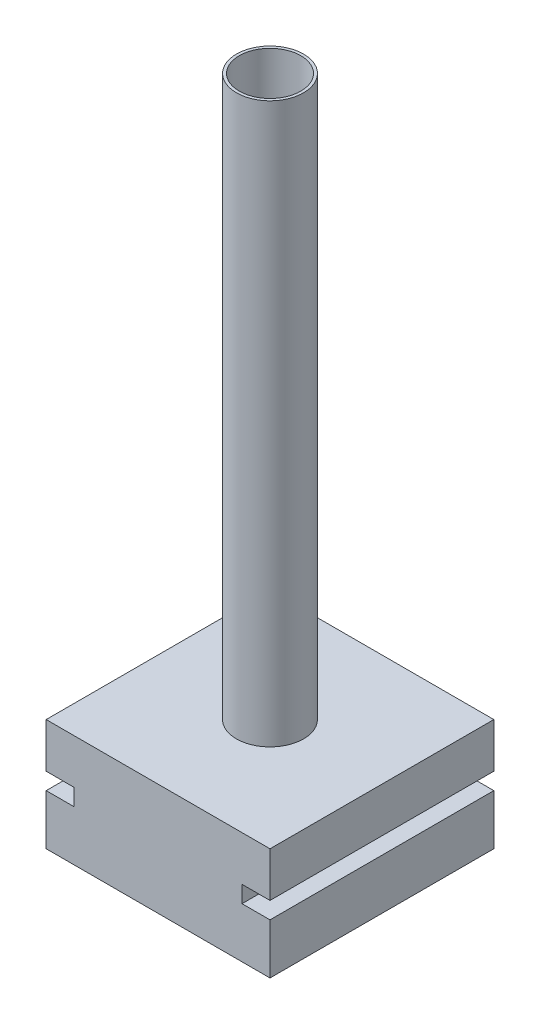
ISO-10303-21;
HEADER;
FILE_DESCRIPTION(('STEP AP214'),'2;1');
FILE_NAME('part.step','',(''),(''),'','','');
FILE_SCHEMA(('AUTOMOTIVE_DESIGN { 1 0 10303 214 1 1 1 1 }'));
ENDSEC;
DATA;
#1=APPLICATION_CONTEXT('core data for automotive mechanical design processes');
#2=APPLICATION_PROTOCOL_DEFINITION('international standard','automotive_design',2000,#1);
#3=PRODUCT_CONTEXT('',#1,'mechanical');
#4=PRODUCT('Part','Part','',(#3));
#5=PRODUCT_RELATED_PRODUCT_CATEGORY('part','',(#4));
#6=PRODUCT_DEFINITION_FORMATION('','',#4);
#7=PRODUCT_DEFINITION_CONTEXT('part definition',#1,'design');
#8=PRODUCT_DEFINITION('design','',#6,#7);
#9=PRODUCT_DEFINITION_SHAPE('','',#8);
#10=(LENGTH_UNIT() NAMED_UNIT(*) SI_UNIT(.MILLI.,.METRE.));
#11=(NAMED_UNIT(*) PLANE_ANGLE_UNIT() SI_UNIT($,.RADIAN.));
#12=(NAMED_UNIT(*) SI_UNIT($,.STERADIAN.) SOLID_ANGLE_UNIT());
#13=UNCERTAINTY_MEASURE_WITH_UNIT(LENGTH_MEASURE(1.E-05),#10,'distance_accuracy_value','');
#14=(GEOMETRIC_REPRESENTATION_CONTEXT(3) GLOBAL_UNCERTAINTY_ASSIGNED_CONTEXT((#13)) GLOBAL_UNIT_ASSIGNED_CONTEXT((#10,
#11,#12)) REPRESENTATION_CONTEXT('',''));
#15=CARTESIAN_POINT('',(0.,0.,0.));
#16=DIRECTION('',(0.,0.,1.));
#17=DIRECTION('',(1.,0.,0.));
#18=AXIS2_PLACEMENT_3D('',#15,#16,#17);
#19=CARTESIAN_POINT('',(-200.,200.,200.));
#20=DIRECTION('',(1.,0.,0.));
#21=DIRECTION('',(0.,0.,-1.));
#22=AXIS2_PLACEMENT_3D('',#19,#20,#21);
#23=PLANE('',#22);
#24=DIRECTION('',(0.,-1.,0.));
#25=VECTOR('',#24,1.);
#26=CARTESIAN_POINT('',(-200.,200.,-200.));
#27=LINE('',#26,#25);
#28=CARTESIAN_POINT('',(-200.,200.,-200.));
#29=VERTEX_POINT('',#28);
#30=CARTESIAN_POINT('',(-200.,120.,-200.));
#31=VERTEX_POINT('',#30);
#32=EDGE_CURVE('E217',#29,#31,#27,.T.);
#33=ORIENTED_EDGE('',*,*,#32,.T.);
#34=DIRECTION('',(0.,0.,-1.));
#35=VECTOR('',#34,1.);
#36=CARTESIAN_POINT('',(-200.,120.,384.));
#37=LINE('',#36,#35);
#38=CARTESIAN_POINT('',(-200.,120.,200.));
#39=VERTEX_POINT('',#38);
#40=EDGE_CURVE('E164',#39,#31,#37,.T.);
#41=ORIENTED_EDGE('',*,*,#40,.F.);
#42=DIRECTION('',(0.,-1.,0.));
#43=VECTOR('',#42,1.);
#44=CARTESIAN_POINT('',(-200.,200.,200.));
#45=LINE('',#44,#43);
#46=CARTESIAN_POINT('',(-200.,200.,200.));
#47=VERTEX_POINT('',#46);
#48=EDGE_CURVE('E44',#47,#39,#45,.T.);
#49=ORIENTED_EDGE('',*,*,#48,.F.);
#50=DIRECTION('',(0.,0.,1.));
#51=VECTOR('',#50,1.);
#52=CARTESIAN_POINT('',(-200.,200.,200.));
#53=LINE('',#52,#51);
#54=EDGE_CURVE('E196',#29,#47,#53,.T.);
#55=ORIENTED_EDGE('',*,*,#54,.F.);
#56=EDGE_LOOP('',(#33,#41,#49,#55));
#57=FACE_BOUND('',#56,.T.);
#58=ADVANCED_FACE('F36',(#57),#23,.F.);
#59=CARTESIAN_POINT('',(200.,200.,200.));
#60=DIRECTION('',(-1.,0.,0.));
#61=DIRECTION('',(0.,0.,1.));
#62=AXIS2_PLACEMENT_3D('',#59,#60,#61);
#63=PLANE('',#62);
#64=DIRECTION('',(0.,-1.,0.));
#65=VECTOR('',#64,1.);
#66=CARTESIAN_POINT('',(200.,200.,-200.));
#67=LINE('',#66,#65);
#68=CARTESIAN_POINT('',(200.,90.,-200.));
#69=VERTEX_POINT('',#68);
#70=CARTESIAN_POINT('',(200.,0.,-200.));
#71=VERTEX_POINT('',#70);
#72=EDGE_CURVE('E220',#69,#71,#67,.T.);
#73=ORIENTED_EDGE('',*,*,#72,.F.);
#74=DIRECTION('',(0.,0.,-1.));
#75=VECTOR('',#74,1.);
#76=CARTESIAN_POINT('',(200.,90.,384.));
#77=LINE('',#76,#75);
#78=CARTESIAN_POINT('',(200.,90.,200.));
#79=VERTEX_POINT('',#78);
#80=EDGE_CURVE('E153',#79,#69,#77,.T.);
#81=ORIENTED_EDGE('',*,*,#80,.F.);
#82=DIRECTION('',(0.,-1.,0.));
#83=VECTOR('',#82,1.);
#84=CARTESIAN_POINT('',(200.,200.,200.));
#85=LINE('',#84,#83);
#86=CARTESIAN_POINT('',(200.,0.,200.));
#87=VERTEX_POINT('',#86);
#88=EDGE_CURVE('E222',#79,#87,#85,.T.);
#89=ORIENTED_EDGE('',*,*,#88,.T.);
#90=DIRECTION('',(0.,0.,-1.));
#91=VECTOR('',#90,1.);
#92=CARTESIAN_POINT('',(200.,0.,200.));
#93=LINE('',#92,#91);
#94=EDGE_CURVE('E212',#87,#71,#93,.T.);
#95=ORIENTED_EDGE('',*,*,#94,.T.);
#96=EDGE_LOOP('',(#73,#81,#89,#95));
#97=FACE_BOUND('',#96,.T.);
#98=ADVANCED_FACE('F244',(#97),#63,.F.);
#99=CARTESIAN_POINT('',(-200.,90.0000000000001,200.));
#100=VERTEX_POINT('',#99);
#101=CARTESIAN_POINT('',(-200.,0.,200.));
#102=VERTEX_POINT('',#101);
#103=EDGE_CURVE('E225',#100,#102,#45,.T.);
#104=ORIENTED_EDGE('',*,*,#103,.F.);
#105=DIRECTION('',(0.,0.,-1.));
#106=VECTOR('',#105,1.);
#107=CARTESIAN_POINT('',(-200.,90.0000000000001,384.));
#108=LINE('',#107,#106);
#109=CARTESIAN_POINT('',(-200.,90.0000000000001,-200.));
#110=VERTEX_POINT('',#109);
#111=EDGE_CURVE('E166',#100,#110,#108,.T.);
#112=ORIENTED_EDGE('',*,*,#111,.T.);
#113=CARTESIAN_POINT('',(-200.,0.,-200.));
#114=VERTEX_POINT('',#113);
#115=EDGE_CURVE('E206',#110,#114,#27,.T.);
#116=ORIENTED_EDGE('',*,*,#115,.T.);
#117=DIRECTION('',(0.,0.,1.));
#118=VECTOR('',#117,1.);
#119=CARTESIAN_POINT('',(-200.,0.,200.));
#120=LINE('',#119,#118);
#121=EDGE_CURVE('E193',#114,#102,#120,.T.);
#122=ORIENTED_EDGE('',*,*,#121,.T.);
#123=EDGE_LOOP('',(#104,#112,#116,#122));
#124=FACE_BOUND('',#123,.T.);
#125=ADVANCED_FACE('F38',(#124),#23,.F.);
#126=CARTESIAN_POINT('',(200.,200.,200.));
#127=DIRECTION('',(0.,0.,-1.));
#128=DIRECTION('',(-1.,0.,0.));
#129=AXIS2_PLACEMENT_3D('',#126,#127,#128);
#130=PLANE('',#129);
#131=ORIENTED_EDGE('',*,*,#88,.F.);
#132=DIRECTION('',(-1.,0.,0.));
#133=VECTOR('',#132,1.);
#134=CARTESIAN_POINT('',(200.,90.,200.));
#135=LINE('',#134,#133);
#136=CARTESIAN_POINT('',(150.,90.,200.));
#137=VERTEX_POINT('',#136);
#138=EDGE_CURVE('E183',#79,#137,#135,.T.);
#139=ORIENTED_EDGE('',*,*,#138,.T.);
#140=DIRECTION('',(0.,1.,0.));
#141=VECTOR('',#140,1.);
#142=CARTESIAN_POINT('',(150.,200.,200.));
#143=LINE('',#142,#141);
#144=CARTESIAN_POINT('',(150.,120.,200.));
#145=VERTEX_POINT('',#144);
#146=EDGE_CURVE('E180',#137,#145,#143,.T.);
#147=ORIENTED_EDGE('',*,*,#146,.T.);
#148=DIRECTION('',(1.,0.,0.));
#149=VECTOR('',#148,1.);
#150=CARTESIAN_POINT('',(200.,120.,200.));
#151=LINE('',#150,#149);
#152=CARTESIAN_POINT('',(200.,120.,200.));
#153=VERTEX_POINT('',#152);
#154=EDGE_CURVE('E133',#145,#153,#151,.T.);
#155=ORIENTED_EDGE('',*,*,#154,.T.);
#156=CARTESIAN_POINT('',(200.,200.,200.));
#157=VERTEX_POINT('',#156);
#158=EDGE_CURVE('E223',#157,#153,#85,.T.);
#159=ORIENTED_EDGE('',*,*,#158,.F.);
#160=DIRECTION('',(1.,0.,0.));
#161=VECTOR('',#160,1.);
#162=CARTESIAN_POINT('',(200.,200.,200.));
#163=LINE('',#162,#161);
#164=EDGE_CURVE('E199',#47,#157,#163,.T.);
#165=ORIENTED_EDGE('',*,*,#164,.F.);
#166=ORIENTED_EDGE('',*,*,#48,.T.);
#167=DIRECTION('',(1.,0.,0.));
#168=VECTOR('',#167,1.);
#169=CARTESIAN_POINT('',(200.,120.,200.));
#170=LINE('',#169,#168);
#171=CARTESIAN_POINT('',(-150.,120.,200.));
#172=VERTEX_POINT('',#171);
#173=EDGE_CURVE('E177',#39,#172,#170,.T.);
#174=ORIENTED_EDGE('',*,*,#173,.T.);
#175=DIRECTION('',(0.,-1.,0.));
#176=VECTOR('',#175,1.);
#177=CARTESIAN_POINT('',(-150.,200.,200.));
#178=LINE('',#177,#176);
#179=CARTESIAN_POINT('',(-150.,90.0000000000001,200.));
#180=VERTEX_POINT('',#179);
#181=EDGE_CURVE('E155',#172,#180,#178,.T.);
#182=ORIENTED_EDGE('',*,*,#181,.T.);
#183=DIRECTION('',(-1.,0.,0.));
#184=VECTOR('',#183,1.);
#185=CARTESIAN_POINT('',(200.,89.9999999999999,200.));
#186=LINE('',#185,#184);
#187=EDGE_CURVE('E174',#180,#100,#186,.T.);
#188=ORIENTED_EDGE('',*,*,#187,.T.);
#189=ORIENTED_EDGE('',*,*,#103,.T.);
#190=DIRECTION('',(1.,0.,0.));
#191=VECTOR('',#190,1.);
#192=CARTESIAN_POINT('',(200.,0.,200.));
#193=LINE('',#192,#191);
#194=EDGE_CURVE('E209',#102,#87,#193,.T.);
#195=ORIENTED_EDGE('',*,*,#194,.T.);
#196=EDGE_LOOP('',(#131,#139,#147,#155,#159,#165,#166,#174,#182,#188,#189,#195));
#197=FACE_BOUND('',#196,.T.);
#198=ADVANCED_FACE('F232',(#197),#130,.F.);
#199=ORIENTED_EDGE('',*,*,#158,.T.);
#200=DIRECTION('',(0.,0.,-1.));
#201=VECTOR('',#200,1.);
#202=CARTESIAN_POINT('',(200.,120.,384.));
#203=LINE('',#202,#201);
#204=CARTESIAN_POINT('',(200.,120.,-200.));
#205=VERTEX_POINT('',#204);
#206=EDGE_CURVE('E136',#153,#205,#203,.T.);
#207=ORIENTED_EDGE('',*,*,#206,.T.);
#208=CARTESIAN_POINT('',(200.,200.,-200.));
#209=VERTEX_POINT('',#208);
#210=EDGE_CURVE('E148',#209,#205,#67,.T.);
#211=ORIENTED_EDGE('',*,*,#210,.F.);
#212=DIRECTION('',(0.,0.,-1.));
#213=VECTOR('',#212,1.);
#214=CARTESIAN_POINT('',(200.,200.,200.));
#215=LINE('',#214,#213);
#216=EDGE_CURVE('E202',#157,#209,#215,.T.);
#217=ORIENTED_EDGE('',*,*,#216,.F.);
#218=EDGE_LOOP('',(#199,#207,#211,#217));
#219=FACE_BOUND('',#218,.T.);
#220=ADVANCED_FACE('F265',(#219),#63,.F.);
#221=CARTESIAN_POINT('',(200.,200.,-200.));
#222=DIRECTION('',(0.,0.,1.));
#223=DIRECTION('',(1.,0.,0.));
#224=AXIS2_PLACEMENT_3D('',#221,#222,#223);
#225=PLANE('',#224);
#226=DIRECTION('',(0.,1.,0.));
#227=VECTOR('',#226,1.);
#228=CARTESIAN_POINT('',(150.,90.,-200.));
#229=LINE('',#228,#227);
#230=CARTESIAN_POINT('',(150.,90.,-200.));
#231=VERTEX_POINT('',#230);
#232=CARTESIAN_POINT('',(150.,120.,-200.));
#233=VERTEX_POINT('',#232);
#234=EDGE_CURVE('E140',#231,#233,#229,.T.);
#235=ORIENTED_EDGE('',*,*,#234,.F.);
#236=DIRECTION('',(-1.,0.,0.));
#237=VECTOR('',#236,1.);
#238=CARTESIAN_POINT('',(200.,90.,-200.));
#239=LINE('',#238,#237);
#240=EDGE_CURVE('E51',#69,#231,#239,.T.);
#241=ORIENTED_EDGE('',*,*,#240,.F.);
#242=ORIENTED_EDGE('',*,*,#72,.T.);
#243=DIRECTION('',(-1.,0.,0.));
#244=VECTOR('',#243,1.);
#245=CARTESIAN_POINT('',(200.,0.,-200.));
#246=LINE('',#245,#244);
#247=EDGE_CURVE('E200',#71,#114,#246,.T.);
#248=ORIENTED_EDGE('',*,*,#247,.T.);
#249=ORIENTED_EDGE('',*,*,#115,.F.);
#250=DIRECTION('',(-1.,0.,0.));
#251=VECTOR('',#250,1.);
#252=CARTESIAN_POINT('',(-200.,90.0000000000001,-200.));
#253=LINE('',#252,#251);
#254=CARTESIAN_POINT('',(-150.,90.0000000000001,-200.));
#255=VERTEX_POINT('',#254);
#256=EDGE_CURVE('E161',#255,#110,#253,.T.);
#257=ORIENTED_EDGE('',*,*,#256,.F.);
#258=DIRECTION('',(0.,-1.,0.));
#259=VECTOR('',#258,1.);
#260=CARTESIAN_POINT('',(-150.,90.0000000000001,-200.));
#261=LINE('',#260,#259);
#262=CARTESIAN_POINT('',(-150.,120.,-200.));
#263=VERTEX_POINT('',#262);
#264=EDGE_CURVE('E158',#263,#255,#261,.T.);
#265=ORIENTED_EDGE('',*,*,#264,.F.);
#266=DIRECTION('',(1.,0.,0.));
#267=VECTOR('',#266,1.);
#268=CARTESIAN_POINT('',(-150.,120.,-200.));
#269=LINE('',#268,#267);
#270=EDGE_CURVE('E59',#31,#263,#269,.T.);
#271=ORIENTED_EDGE('',*,*,#270,.F.);
#272=ORIENTED_EDGE('',*,*,#32,.F.);
#273=DIRECTION('',(-1.,0.,0.));
#274=VECTOR('',#273,1.);
#275=CARTESIAN_POINT('',(200.,200.,-200.));
#276=LINE('',#275,#274);
#277=EDGE_CURVE('E204',#209,#29,#276,.T.);
#278=ORIENTED_EDGE('',*,*,#277,.F.);
#279=ORIENTED_EDGE('',*,*,#210,.T.);
#280=DIRECTION('',(1.,0.,0.));
#281=VECTOR('',#280,1.);
#282=CARTESIAN_POINT('',(150.,120.,-200.));
#283=LINE('',#282,#281);
#284=EDGE_CURVE('E130',#233,#205,#283,.T.);
#285=ORIENTED_EDGE('',*,*,#284,.F.);
#286=EDGE_LOOP('',(#235,#241,#242,#248,#249,#257,#265,#271,#272,#278,#279,#285));
#287=FACE_BOUND('',#286,.T.);
#288=ADVANCED_FACE('F145',(#287),#225,.F.);
#289=CARTESIAN_POINT('',(0.,200.,0.));
#290=DIRECTION('',(0.,1.,0.));
#291=DIRECTION('',(0.,0.,1.));
#292=AXIS2_PLACEMENT_3D('',#289,#290,#291);
#293=PLANE('',#292);
#294=CARTESIAN_POINT('',(0.,200.,0.));
#295=DIRECTION('',(0.,1.,0.));
#296=DIRECTION('',(0.,0.,1.));
#297=AXIS2_PLACEMENT_3D('',#294,#295,#296);
#298=CIRCLE('',#297,60.);
#299=CARTESIAN_POINT('',(0.,200.,60.));
#300=VERTEX_POINT('',#299);
#301=EDGE_CURVE('E189',#300,#300,#298,.T.);
#302=ORIENTED_EDGE('',*,*,#301,.F.);
#303=EDGE_LOOP('',(#302));
#304=FACE_BOUND('',#303,.T.);
#305=ORIENTED_EDGE('',*,*,#54,.T.);
#306=ORIENTED_EDGE('',*,*,#164,.T.);
#307=ORIENTED_EDGE('',*,*,#216,.T.);
#308=ORIENTED_EDGE('',*,*,#277,.T.);
#309=EDGE_LOOP('',(#305,#306,#307,#308));
#310=FACE_BOUND('',#309,.T.);
#311=ADVANCED_FACE('F277',(#304,#310),#293,.T.);
#312=CARTESIAN_POINT('',(0.,0.,0.));
#313=DIRECTION('',(0.,1.,0.));
#314=DIRECTION('',(0.,0.,1.));
#315=AXIS2_PLACEMENT_3D('',#312,#313,#314);
#316=PLANE('',#315);
#317=ORIENTED_EDGE('',*,*,#121,.F.);
#318=ORIENTED_EDGE('',*,*,#247,.F.);
#319=ORIENTED_EDGE('',*,*,#94,.F.);
#320=ORIENTED_EDGE('',*,*,#194,.F.);
#321=EDGE_LOOP('',(#317,#318,#319,#320));
#322=FACE_BOUND('',#321,.T.);
#323=ADVANCED_FACE('F237',(#322),#316,.F.);
#324=CARTESIAN_POINT('',(0.,1200.,0.));
#325=DIRECTION('',(0.,1.,0.));
#326=DIRECTION('',(0.,0.,1.));
#327=AXIS2_PLACEMENT_3D('',#324,#325,#326);
#328=PLANE('',#327);
#329=CARTESIAN_POINT('',(0.,1200.,0.));
#330=DIRECTION('',(0.,1.,0.));
#331=DIRECTION('',(0.,0.,1.));
#332=AXIS2_PLACEMENT_3D('',#329,#330,#331);
#333=CIRCLE('',#332,60.);
#334=CARTESIAN_POINT('',(0.,1200.,60.));
#335=VERTEX_POINT('',#334);
#336=EDGE_CURVE('E190',#335,#335,#333,.T.);
#337=ORIENTED_EDGE('',*,*,#336,.T.);
#338=EDGE_LOOP('',(#337));
#339=FACE_BOUND('',#338,.T.);
#340=CARTESIAN_POINT('',(0.,1200.,0.));
#341=DIRECTION('',(0.,1.,0.));
#342=DIRECTION('',(0.,0.,1.));
#343=AXIS2_PLACEMENT_3D('',#340,#341,#342);
#344=CIRCLE('',#343,55.);
#345=CARTESIAN_POINT('',(0.,1200.,55.));
#346=VERTEX_POINT('',#345);
#347=EDGE_CURVE('E186',#346,#346,#344,.T.);
#348=ORIENTED_EDGE('',*,*,#347,.F.);
#349=EDGE_LOOP('',(#348));
#350=FACE_BOUND('',#349,.T.);
#351=ADVANCED_FACE('F280',(#339,#350),#328,.T.);
#352=CARTESIAN_POINT('',(0.,1200.,0.));
#353=DIRECTION('',(0.,-1.,0.));
#354=DIRECTION('',(0.,0.,-1.));
#355=AXIS2_PLACEMENT_3D('',#352,#353,#354);
#356=CYLINDRICAL_SURFACE('',#355,60.);
#357=ORIENTED_EDGE('',*,*,#336,.F.);
#358=EDGE_LOOP('',(#357));
#359=FACE_BOUND('',#358,.T.);
#360=ORIENTED_EDGE('',*,*,#301,.T.);
#361=EDGE_LOOP('',(#360));
#362=FACE_BOUND('',#361,.T.);
#363=ADVANCED_FACE('F285',(#359,#362),#356,.T.);
#364=CARTESIAN_POINT('',(0.,1200.,0.));
#365=DIRECTION('',(0.,-1.,0.));
#366=DIRECTION('',(0.,0.,-1.));
#367=AXIS2_PLACEMENT_3D('',#364,#365,#366);
#368=CYLINDRICAL_SURFACE('',#367,55.);
#369=ORIENTED_EDGE('',*,*,#347,.T.);
#370=EDGE_LOOP('',(#369));
#371=FACE_BOUND('',#370,.T.);
#372=CARTESIAN_POINT('',(0.,200.,0.));
#373=DIRECTION('',(0.,1.,0.));
#374=DIRECTION('',(0.,0.,1.));
#375=AXIS2_PLACEMENT_3D('',#372,#373,#374);
#376=CIRCLE('',#375,55.);
#377=CARTESIAN_POINT('',(0.,200.,55.));
#378=VERTEX_POINT('',#377);
#379=EDGE_CURVE('E11',#378,#378,#376,.F.);
#380=ORIENTED_EDGE('',*,*,#379,.T.);
#381=EDGE_LOOP('',(#380));
#382=FACE_BOUND('',#381,.T.);
#383=ADVANCED_FACE('F288',(#371,#382),#368,.F.);
#384=ORIENTED_EDGE('',*,*,#379,.F.);
#385=EDGE_LOOP('',(#384));
#386=FACE_BOUND('',#385,.T.);
#387=ADVANCED_FACE('F284',(#386),#293,.T.);
#388=CARTESIAN_POINT('',(-150.,120.,384.));
#389=DIRECTION('',(0.,1.,0.));
#390=DIRECTION('',(-1.,0.,0.));
#391=AXIS2_PLACEMENT_3D('',#388,#389,#390);
#392=PLANE('',#391);
#393=ORIENTED_EDGE('',*,*,#40,.T.);
#394=ORIENTED_EDGE('',*,*,#270,.T.);
#395=DIRECTION('',(0.,0.,-1.));
#396=VECTOR('',#395,1.);
#397=CARTESIAN_POINT('',(-150.,120.,384.));
#398=LINE('',#397,#396);
#399=EDGE_CURVE('E163',#172,#263,#398,.T.);
#400=ORIENTED_EDGE('',*,*,#399,.F.);
#401=ORIENTED_EDGE('',*,*,#173,.F.);
#402=EDGE_LOOP('',(#393,#394,#400,#401));
#403=FACE_BOUND('',#402,.T.);
#404=ADVANCED_FACE('F296',(#403),#392,.F.);
#405=CARTESIAN_POINT('',(-200.,90.0000000000001,384.));
#406=DIRECTION('',(0.,-1.,0.));
#407=DIRECTION('',(1.,0.,0.));
#408=AXIS2_PLACEMENT_3D('',#405,#406,#407);
#409=PLANE('',#408);
#410=DIRECTION('',(0.,0.,-1.));
#411=VECTOR('',#410,1.);
#412=CARTESIAN_POINT('',(-150.,90.0000000000001,384.));
#413=LINE('',#412,#411);
#414=EDGE_CURVE('E169',#180,#255,#413,.T.);
#415=ORIENTED_EDGE('',*,*,#414,.T.);
#416=ORIENTED_EDGE('',*,*,#256,.T.);
#417=ORIENTED_EDGE('',*,*,#111,.F.);
#418=ORIENTED_EDGE('',*,*,#187,.F.);
#419=EDGE_LOOP('',(#415,#416,#417,#418));
#420=FACE_BOUND('',#419,.T.);
#421=ADVANCED_FACE('F254',(#420),#409,.F.);
#422=CARTESIAN_POINT('',(-150.,90.0000000000001,384.));
#423=DIRECTION('',(1.,0.,0.));
#424=DIRECTION('',(0.,0.,-1.));
#425=AXIS2_PLACEMENT_3D('',#422,#423,#424);
#426=PLANE('',#425);
#427=ORIENTED_EDGE('',*,*,#399,.T.);
#428=ORIENTED_EDGE('',*,*,#264,.T.);
#429=ORIENTED_EDGE('',*,*,#414,.F.);
#430=ORIENTED_EDGE('',*,*,#181,.F.);
#431=EDGE_LOOP('',(#427,#428,#429,#430));
#432=FACE_BOUND('',#431,.T.);
#433=ADVANCED_FACE('F247',(#432),#426,.F.);
#434=CARTESIAN_POINT('',(200.,90.,384.));
#435=DIRECTION('',(0.,-1.,0.));
#436=DIRECTION('',(0.,0.,-1.));
#437=AXIS2_PLACEMENT_3D('',#434,#435,#436);
#438=PLANE('',#437);
#439=ORIENTED_EDGE('',*,*,#80,.T.);
#440=ORIENTED_EDGE('',*,*,#240,.T.);
#441=DIRECTION('',(0.,0.,-1.));
#442=VECTOR('',#441,1.);
#443=CARTESIAN_POINT('',(150.,90.,384.));
#444=LINE('',#443,#442);
#445=EDGE_CURVE('E137',#137,#231,#444,.T.);
#446=ORIENTED_EDGE('',*,*,#445,.F.);
#447=ORIENTED_EDGE('',*,*,#138,.F.);
#448=EDGE_LOOP('',(#439,#440,#446,#447));
#449=FACE_BOUND('',#448,.T.);
#450=ADVANCED_FACE('F245',(#449),#438,.F.);
#451=CARTESIAN_POINT('',(150.,120.,384.));
#452=DIRECTION('',(0.,1.,0.));
#453=DIRECTION('',(0.,0.,1.));
#454=AXIS2_PLACEMENT_3D('',#451,#452,#453);
#455=PLANE('',#454);
#456=DIRECTION('',(0.,0.,-1.));
#457=VECTOR('',#456,1.);
#458=CARTESIAN_POINT('',(150.,120.,384.));
#459=LINE('',#458,#457);
#460=EDGE_CURVE('E126',#145,#233,#459,.T.);
#461=ORIENTED_EDGE('',*,*,#460,.T.);
#462=ORIENTED_EDGE('',*,*,#284,.T.);
#463=ORIENTED_EDGE('',*,*,#206,.F.);
#464=ORIENTED_EDGE('',*,*,#154,.F.);
#465=EDGE_LOOP('',(#461,#462,#463,#464));
#466=FACE_BOUND('',#465,.T.);
#467=ADVANCED_FACE('F128',(#466),#455,.F.);
#468=CARTESIAN_POINT('',(150.,90.,384.));
#469=DIRECTION('',(-1.,0.,0.));
#470=DIRECTION('',(0.,0.,1.));
#471=AXIS2_PLACEMENT_3D('',#468,#469,#470);
#472=PLANE('',#471);
#473=ORIENTED_EDGE('',*,*,#445,.T.);
#474=ORIENTED_EDGE('',*,*,#234,.T.);
#475=ORIENTED_EDGE('',*,*,#460,.F.);
#476=ORIENTED_EDGE('',*,*,#146,.F.);
#477=EDGE_LOOP('',(#473,#474,#475,#476));
#478=FACE_BOUND('',#477,.T.);
#479=ADVANCED_FACE('F141',(#478),#472,.F.);
#480=CLOSED_SHELL('',(#58,#98,#125,#198,#220,#288,#311,#323,#351,#363,#383,#387,#404,#421,#433,
#450,#467,#479));
#481=MANIFOLD_SOLID_BREP('B2',#480);
#482=ADVANCED_BREP_SHAPE_REPRESENTATION('',(#18,#481),#14);
#483=SHAPE_DEFINITION_REPRESENTATION(#9,#482);
ENDSEC;
END-ISO-10303-21;
